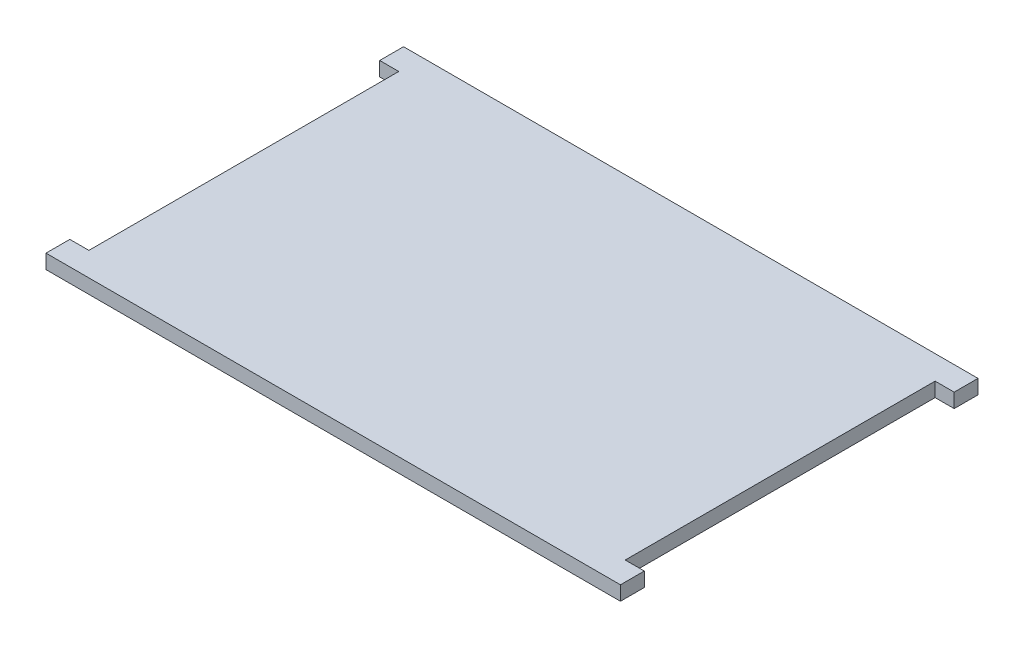
ISO-10303-21;
HEADER;
FILE_DESCRIPTION(('STEP AP214'),'2;1');
FILE_NAME('part.step','',(''),(''),'','','');
FILE_SCHEMA(('AUTOMOTIVE_DESIGN { 1 0 10303 214 1 1 1 1 }'));
ENDSEC;
DATA;
#1=APPLICATION_CONTEXT('core data for automotive mechanical design processes');
#2=APPLICATION_PROTOCOL_DEFINITION('international standard','automotive_design',2000,#1);
#3=PRODUCT_CONTEXT('',#1,'mechanical');
#4=PRODUCT('Part','Part','',(#3));
#5=PRODUCT_RELATED_PRODUCT_CATEGORY('part','',(#4));
#6=PRODUCT_DEFINITION_FORMATION('','',#4);
#7=PRODUCT_DEFINITION_CONTEXT('part definition',#1,'design');
#8=PRODUCT_DEFINITION('design','',#6,#7);
#9=PRODUCT_DEFINITION_SHAPE('','',#8);
#10=(LENGTH_UNIT() NAMED_UNIT(*) SI_UNIT(.MILLI.,.METRE.));
#11=(NAMED_UNIT(*) PLANE_ANGLE_UNIT() SI_UNIT($,.RADIAN.));
#12=(NAMED_UNIT(*) SI_UNIT($,.STERADIAN.) SOLID_ANGLE_UNIT());
#13=UNCERTAINTY_MEASURE_WITH_UNIT(LENGTH_MEASURE(1.E-05),#10,'distance_accuracy_value','');
#14=(GEOMETRIC_REPRESENTATION_CONTEXT(3) GLOBAL_UNCERTAINTY_ASSIGNED_CONTEXT((#13)) GLOBAL_UNIT_ASSIGNED_CONTEXT((#10,
#11,#12)) REPRESENTATION_CONTEXT('',''));
#15=CARTESIAN_POINT('',(0.,0.,0.));
#16=DIRECTION('',(0.,0.,1.));
#17=DIRECTION('',(1.,0.,0.));
#18=AXIS2_PLACEMENT_3D('',#15,#16,#17);
#19=CARTESIAN_POINT('',(-120.5,6.,-75.));
#20=DIRECTION('',(1.,0.,0.));
#21=DIRECTION('',(0.,0.,-1.));
#22=AXIS2_PLACEMENT_3D('',#19,#20,#21);
#23=PLANE('',#22);
#24=DIRECTION('',(0.,0.,1.));
#25=VECTOR('',#24,1.);
#26=CARTESIAN_POINT('',(-120.5,0.,-75.));
#27=LINE('',#26,#25);
#28=CARTESIAN_POINT('',(-120.5,0.,-75.));
#29=VERTEX_POINT('',#28);
#30=CARTESIAN_POINT('',(-120.5,0.,-65.));
#31=VERTEX_POINT('',#30);
#32=EDGE_CURVE('E154',#29,#31,#27,.T.);
#33=ORIENTED_EDGE('',*,*,#32,.T.);
#34=DIRECTION('',(0.,-1.,0.));
#35=VECTOR('',#34,1.);
#36=CARTESIAN_POINT('',(-120.5,6.,-65.));
#37=LINE('',#36,#35);
#38=CARTESIAN_POINT('',(-120.5,6.,-65.));
#39=VERTEX_POINT('',#38);
#40=EDGE_CURVE('E11',#39,#31,#37,.T.);
#41=ORIENTED_EDGE('',*,*,#40,.F.);
#42=DIRECTION('',(0.,0.,1.));
#43=VECTOR('',#42,1.);
#44=CARTESIAN_POINT('',(-120.5,6.,-75.));
#45=LINE('',#44,#43);
#46=CARTESIAN_POINT('',(-120.5,6.,-75.));
#47=VERTEX_POINT('',#46);
#48=EDGE_CURVE('E176',#47,#39,#45,.T.);
#49=ORIENTED_EDGE('',*,*,#48,.F.);
#50=DIRECTION('',(0.,-1.,0.));
#51=VECTOR('',#50,1.);
#52=CARTESIAN_POINT('',(-120.5,6.,-75.));
#53=LINE('',#52,#51);
#54=EDGE_CURVE('E150',#47,#29,#53,.T.);
#55=ORIENTED_EDGE('',*,*,#54,.T.);
#56=EDGE_LOOP('',(#33,#41,#49,#55));
#57=FACE_BOUND('',#56,.T.);
#58=ADVANCED_FACE('F34',(#57),#23,.F.);
#59=CARTESIAN_POINT('',(-120.5,6.,-65.));
#60=DIRECTION('',(0.,0.,-1.));
#61=DIRECTION('',(-1.,0.,0.));
#62=AXIS2_PLACEMENT_3D('',#59,#60,#61);
#63=PLANE('',#62);
#64=DIRECTION('',(1.,0.,0.));
#65=VECTOR('',#64,1.);
#66=CARTESIAN_POINT('',(-120.5,0.,-65.));
#67=LINE('',#66,#65);
#68=CARTESIAN_POINT('',(-112.5,0.,-65.));
#69=VERTEX_POINT('',#68);
#70=EDGE_CURVE('E157',#31,#69,#67,.T.);
#71=ORIENTED_EDGE('',*,*,#70,.T.);
#72=DIRECTION('',(0.,-1.,0.));
#73=VECTOR('',#72,1.);
#74=CARTESIAN_POINT('',(-112.5,6.,-65.));
#75=LINE('',#74,#73);
#76=CARTESIAN_POINT('',(-112.5,6.,-65.));
#77=VERTEX_POINT('',#76);
#78=EDGE_CURVE('E42',#77,#69,#75,.T.);
#79=ORIENTED_EDGE('',*,*,#78,.F.);
#80=DIRECTION('',(1.,0.,0.));
#81=VECTOR('',#80,1.);
#82=CARTESIAN_POINT('',(-120.5,6.,-65.));
#83=LINE('',#82,#81);
#84=EDGE_CURVE('E105',#39,#77,#83,.T.);
#85=ORIENTED_EDGE('',*,*,#84,.F.);
#86=ORIENTED_EDGE('',*,*,#40,.T.);
#87=EDGE_LOOP('',(#71,#79,#85,#86));
#88=FACE_BOUND('',#87,.T.);
#89=ADVANCED_FACE('F254',(#88),#63,.F.);
#90=CARTESIAN_POINT('',(-112.5,6.,-65.));
#91=DIRECTION('',(1.,0.,0.));
#92=DIRECTION('',(0.,0.,-1.));
#93=AXIS2_PLACEMENT_3D('',#90,#91,#92);
#94=PLANE('',#93);
#95=DIRECTION('',(0.,0.,1.));
#96=VECTOR('',#95,1.);
#97=CARTESIAN_POINT('',(-112.5,0.,-65.));
#98=LINE('',#97,#96);
#99=CARTESIAN_POINT('',(-112.5,0.,65.));
#100=VERTEX_POINT('',#99);
#101=EDGE_CURVE('E159',#69,#100,#98,.T.);
#102=ORIENTED_EDGE('',*,*,#101,.T.);
#103=DIRECTION('',(0.,-1.,0.));
#104=VECTOR('',#103,1.);
#105=CARTESIAN_POINT('',(-112.5,6.,65.));
#106=LINE('',#105,#104);
#107=CARTESIAN_POINT('',(-112.5,6.,65.));
#108=VERTEX_POINT('',#107);
#109=EDGE_CURVE('E195',#108,#100,#106,.T.);
#110=ORIENTED_EDGE('',*,*,#109,.F.);
#111=DIRECTION('',(0.,0.,1.));
#112=VECTOR('',#111,1.);
#113=CARTESIAN_POINT('',(-112.5,6.,-65.));
#114=LINE('',#113,#112);
#115=EDGE_CURVE('E203',#77,#108,#114,.T.);
#116=ORIENTED_EDGE('',*,*,#115,.F.);
#117=ORIENTED_EDGE('',*,*,#78,.T.);
#118=EDGE_LOOP('',(#102,#110,#116,#117));
#119=FACE_BOUND('',#118,.T.);
#120=ADVANCED_FACE('F201',(#119),#94,.F.);
#121=CARTESIAN_POINT('',(-120.5,6.,65.));
#122=DIRECTION('',(0.,0.,1.));
#123=DIRECTION('',(1.,0.,0.));
#124=AXIS2_PLACEMENT_3D('',#121,#122,#123);
#125=PLANE('',#124);
#126=DIRECTION('',(-1.,0.,0.));
#127=VECTOR('',#126,1.);
#128=CARTESIAN_POINT('',(-120.5,0.,65.));
#129=LINE('',#128,#127);
#130=CARTESIAN_POINT('',(-120.5,0.,65.));
#131=VERTEX_POINT('',#130);
#132=EDGE_CURVE('E161',#100,#131,#129,.T.);
#133=ORIENTED_EDGE('',*,*,#132,.T.);
#134=DIRECTION('',(0.,-1.,0.));
#135=VECTOR('',#134,1.);
#136=CARTESIAN_POINT('',(-120.5,6.,65.));
#137=LINE('',#136,#135);
#138=CARTESIAN_POINT('',(-120.5,6.,65.));
#139=VERTEX_POINT('',#138);
#140=EDGE_CURVE('E192',#139,#131,#137,.T.);
#141=ORIENTED_EDGE('',*,*,#140,.F.);
#142=DIRECTION('',(-1.,0.,0.));
#143=VECTOR('',#142,1.);
#144=CARTESIAN_POINT('',(-120.5,6.,65.));
#145=LINE('',#144,#143);
#146=EDGE_CURVE('E221',#108,#139,#145,.T.);
#147=ORIENTED_EDGE('',*,*,#146,.F.);
#148=ORIENTED_EDGE('',*,*,#109,.T.);
#149=EDGE_LOOP('',(#133,#141,#147,#148));
#150=FACE_BOUND('',#149,.T.);
#151=ADVANCED_FACE('F212',(#150),#125,.F.);
#152=CARTESIAN_POINT('',(-120.5,6.,75.));
#153=DIRECTION('',(1.,0.,0.));
#154=DIRECTION('',(0.,0.,-1.));
#155=AXIS2_PLACEMENT_3D('',#152,#153,#154);
#156=PLANE('',#155);
#157=DIRECTION('',(0.,0.,1.));
#158=VECTOR('',#157,1.);
#159=CARTESIAN_POINT('',(-120.5,0.,75.));
#160=LINE('',#159,#158);
#161=CARTESIAN_POINT('',(-120.5,0.,75.));
#162=VERTEX_POINT('',#161);
#163=EDGE_CURVE('E163',#131,#162,#160,.T.);
#164=ORIENTED_EDGE('',*,*,#163,.T.);
#165=DIRECTION('',(0.,-1.,0.));
#166=VECTOR('',#165,1.);
#167=CARTESIAN_POINT('',(-120.5,6.,75.));
#168=LINE('',#167,#166);
#169=CARTESIAN_POINT('',(-120.5,6.,75.));
#170=VERTEX_POINT('',#169);
#171=EDGE_CURVE('E189',#170,#162,#168,.T.);
#172=ORIENTED_EDGE('',*,*,#171,.F.);
#173=DIRECTION('',(0.,0.,1.));
#174=VECTOR('',#173,1.);
#175=CARTESIAN_POINT('',(-120.5,6.,75.));
#176=LINE('',#175,#174);
#177=EDGE_CURVE('E218',#139,#170,#176,.T.);
#178=ORIENTED_EDGE('',*,*,#177,.F.);
#179=ORIENTED_EDGE('',*,*,#140,.T.);
#180=EDGE_LOOP('',(#164,#172,#178,#179));
#181=FACE_BOUND('',#180,.T.);
#182=ADVANCED_FACE('F216',(#181),#156,.F.);
#183=CARTESIAN_POINT('',(-120.5,6.,75.));
#184=DIRECTION('',(0.,0.,-1.));
#185=DIRECTION('',(-1.,0.,0.));
#186=AXIS2_PLACEMENT_3D('',#183,#184,#185);
#187=PLANE('',#186);
#188=DIRECTION('',(1.,0.,0.));
#189=VECTOR('',#188,1.);
#190=CARTESIAN_POINT('',(-120.5,0.,75.));
#191=LINE('',#190,#189);
#192=CARTESIAN_POINT('',(120.5,0.,75.));
#193=VERTEX_POINT('',#192);
#194=EDGE_CURVE('E165',#162,#193,#191,.T.);
#195=ORIENTED_EDGE('',*,*,#194,.T.);
#196=DIRECTION('',(0.,-1.,0.));
#197=VECTOR('',#196,1.);
#198=CARTESIAN_POINT('',(120.5,6.,75.));
#199=LINE('',#198,#197);
#200=CARTESIAN_POINT('',(120.5,6.,75.));
#201=VERTEX_POINT('',#200);
#202=EDGE_CURVE('E186',#201,#193,#199,.T.);
#203=ORIENTED_EDGE('',*,*,#202,.F.);
#204=DIRECTION('',(1.,0.,0.));
#205=VECTOR('',#204,1.);
#206=CARTESIAN_POINT('',(-120.5,6.,75.));
#207=LINE('',#206,#205);
#208=EDGE_CURVE('E220',#170,#201,#207,.T.);
#209=ORIENTED_EDGE('',*,*,#208,.F.);
#210=ORIENTED_EDGE('',*,*,#171,.T.);
#211=EDGE_LOOP('',(#195,#203,#209,#210));
#212=FACE_BOUND('',#211,.T.);
#213=ADVANCED_FACE('F267',(#212),#187,.F.);
#214=CARTESIAN_POINT('',(120.5,6.,75.));
#215=DIRECTION('',(-1.,0.,0.));
#216=DIRECTION('',(0.,0.,1.));
#217=AXIS2_PLACEMENT_3D('',#214,#215,#216);
#218=PLANE('',#217);
#219=DIRECTION('',(0.,0.,-1.));
#220=VECTOR('',#219,1.);
#221=CARTESIAN_POINT('',(120.5,0.,75.));
#222=LINE('',#221,#220);
#223=CARTESIAN_POINT('',(120.5,0.,65.));
#224=VERTEX_POINT('',#223);
#225=EDGE_CURVE('E167',#193,#224,#222,.T.);
#226=ORIENTED_EDGE('',*,*,#225,.T.);
#227=DIRECTION('',(0.,-1.,0.));
#228=VECTOR('',#227,1.);
#229=CARTESIAN_POINT('',(120.5,6.,65.));
#230=LINE('',#229,#228);
#231=CARTESIAN_POINT('',(120.5,6.,65.));
#232=VERTEX_POINT('',#231);
#233=EDGE_CURVE('E183',#232,#224,#230,.T.);
#234=ORIENTED_EDGE('',*,*,#233,.F.);
#235=DIRECTION('',(0.,0.,-1.));
#236=VECTOR('',#235,1.);
#237=CARTESIAN_POINT('',(120.5,6.,75.));
#238=LINE('',#237,#236);
#239=EDGE_CURVE('E223',#201,#232,#238,.T.);
#240=ORIENTED_EDGE('',*,*,#239,.F.);
#241=ORIENTED_EDGE('',*,*,#202,.T.);
#242=EDGE_LOOP('',(#226,#234,#240,#241));
#243=FACE_BOUND('',#242,.T.);
#244=ADVANCED_FACE('F270',(#243),#218,.F.);
#245=CARTESIAN_POINT('',(120.5,6.,65.));
#246=DIRECTION('',(0.,0.,1.));
#247=DIRECTION('',(1.,0.,0.));
#248=AXIS2_PLACEMENT_3D('',#245,#246,#247);
#249=PLANE('',#248);
#250=DIRECTION('',(-1.,0.,0.));
#251=VECTOR('',#250,1.);
#252=CARTESIAN_POINT('',(120.5,0.,65.));
#253=LINE('',#252,#251);
#254=CARTESIAN_POINT('',(112.5,0.,65.));
#255=VERTEX_POINT('',#254);
#256=EDGE_CURVE('E169',#224,#255,#253,.T.);
#257=ORIENTED_EDGE('',*,*,#256,.T.);
#258=DIRECTION('',(0.,-1.,0.));
#259=VECTOR('',#258,1.);
#260=CARTESIAN_POINT('',(112.5,6.,65.));
#261=LINE('',#260,#259);
#262=CARTESIAN_POINT('',(112.5,6.,65.));
#263=VERTEX_POINT('',#262);
#264=EDGE_CURVE('E180',#263,#255,#261,.T.);
#265=ORIENTED_EDGE('',*,*,#264,.F.);
#266=DIRECTION('',(-1.,0.,0.));
#267=VECTOR('',#266,1.);
#268=CARTESIAN_POINT('',(120.5,6.,65.));
#269=LINE('',#268,#267);
#270=EDGE_CURVE('E229',#232,#263,#269,.T.);
#271=ORIENTED_EDGE('',*,*,#270,.F.);
#272=ORIENTED_EDGE('',*,*,#233,.T.);
#273=EDGE_LOOP('',(#257,#265,#271,#272));
#274=FACE_BOUND('',#273,.T.);
#275=ADVANCED_FACE('F235',(#274),#249,.F.);
#276=CARTESIAN_POINT('',(112.5,6.,-65.));
#277=DIRECTION('',(-1.,0.,0.));
#278=DIRECTION('',(0.,0.,1.));
#279=AXIS2_PLACEMENT_3D('',#276,#277,#278);
#280=PLANE('',#279);
#281=DIRECTION('',(0.,0.,-1.));
#282=VECTOR('',#281,1.);
#283=CARTESIAN_POINT('',(112.5,0.,-65.));
#284=LINE('',#283,#282);
#285=CARTESIAN_POINT('',(112.5,0.,-65.));
#286=VERTEX_POINT('',#285);
#287=EDGE_CURVE('E171',#255,#286,#284,.T.);
#288=ORIENTED_EDGE('',*,*,#287,.T.);
#289=DIRECTION('',(0.,-1.,0.));
#290=VECTOR('',#289,1.);
#291=CARTESIAN_POINT('',(112.5,6.,-65.));
#292=LINE('',#291,#290);
#293=CARTESIAN_POINT('',(112.5,6.,-65.));
#294=VERTEX_POINT('',#293);
#295=EDGE_CURVE('E145',#294,#286,#292,.T.);
#296=ORIENTED_EDGE('',*,*,#295,.F.);
#297=DIRECTION('',(0.,0.,-1.));
#298=VECTOR('',#297,1.);
#299=CARTESIAN_POINT('',(112.5,6.,-65.));
#300=LINE('',#299,#298);
#301=EDGE_CURVE('E136',#263,#294,#300,.T.);
#302=ORIENTED_EDGE('',*,*,#301,.F.);
#303=ORIENTED_EDGE('',*,*,#264,.T.);
#304=EDGE_LOOP('',(#288,#296,#302,#303));
#305=FACE_BOUND('',#304,.T.);
#306=ADVANCED_FACE('F239',(#305),#280,.F.);
#307=CARTESIAN_POINT('',(120.5,6.,-65.));
#308=DIRECTION('',(0.,0.,-1.));
#309=DIRECTION('',(-1.,0.,0.));
#310=AXIS2_PLACEMENT_3D('',#307,#308,#309);
#311=PLANE('',#310);
#312=DIRECTION('',(1.,0.,0.));
#313=VECTOR('',#312,1.);
#314=CARTESIAN_POINT('',(120.5,0.,-65.));
#315=LINE('',#314,#313);
#316=CARTESIAN_POINT('',(120.5,0.,-65.));
#317=VERTEX_POINT('',#316);
#318=EDGE_CURVE('E144',#286,#317,#315,.T.);
#319=ORIENTED_EDGE('',*,*,#318,.T.);
#320=DIRECTION('',(0.,-1.,0.));
#321=VECTOR('',#320,1.);
#322=CARTESIAN_POINT('',(120.5,6.,-65.));
#323=LINE('',#322,#321);
#324=CARTESIAN_POINT('',(120.5,6.,-65.));
#325=VERTEX_POINT('',#324);
#326=EDGE_CURVE('E141',#325,#317,#323,.T.);
#327=ORIENTED_EDGE('',*,*,#326,.F.);
#328=DIRECTION('',(1.,0.,0.));
#329=VECTOR('',#328,1.);
#330=CARTESIAN_POINT('',(120.5,6.,-65.));
#331=LINE('',#330,#329);
#332=EDGE_CURVE('E130',#294,#325,#331,.T.);
#333=ORIENTED_EDGE('',*,*,#332,.F.);
#334=ORIENTED_EDGE('',*,*,#295,.T.);
#335=EDGE_LOOP('',(#319,#327,#333,#334));
#336=FACE_BOUND('',#335,.T.);
#337=ADVANCED_FACE('F142',(#336),#311,.F.);
#338=CARTESIAN_POINT('',(120.5,6.,-75.));
#339=DIRECTION('',(-1.,0.,0.));
#340=DIRECTION('',(0.,0.,1.));
#341=AXIS2_PLACEMENT_3D('',#338,#339,#340);
#342=PLANE('',#341);
#343=DIRECTION('',(0.,0.,-1.));
#344=VECTOR('',#343,1.);
#345=CARTESIAN_POINT('',(120.5,0.,-75.));
#346=LINE('',#345,#344);
#347=CARTESIAN_POINT('',(120.5,0.,-75.));
#348=VERTEX_POINT('',#347);
#349=EDGE_CURVE('E91',#317,#348,#346,.T.);
#350=ORIENTED_EDGE('',*,*,#349,.T.);
#351=DIRECTION('',(0.,-1.,0.));
#352=VECTOR('',#351,1.);
#353=CARTESIAN_POINT('',(120.5,6.,-75.));
#354=LINE('',#353,#352);
#355=CARTESIAN_POINT('',(120.5,6.,-75.));
#356=VERTEX_POINT('',#355);
#357=EDGE_CURVE('E146',#356,#348,#354,.T.);
#358=ORIENTED_EDGE('',*,*,#357,.F.);
#359=DIRECTION('',(0.,0.,-1.));
#360=VECTOR('',#359,1.);
#361=CARTESIAN_POINT('',(120.5,6.,-75.));
#362=LINE('',#361,#360);
#363=EDGE_CURVE('E134',#325,#356,#362,.T.);
#364=ORIENTED_EDGE('',*,*,#363,.F.);
#365=ORIENTED_EDGE('',*,*,#326,.T.);
#366=EDGE_LOOP('',(#350,#358,#364,#365));
#367=FACE_BOUND('',#366,.T.);
#368=ADVANCED_FACE('F148',(#367),#342,.F.);
#369=CARTESIAN_POINT('',(-120.5,6.,-75.));
#370=DIRECTION('',(0.,0.,1.));
#371=DIRECTION('',(1.,0.,0.));
#372=AXIS2_PLACEMENT_3D('',#369,#370,#371);
#373=PLANE('',#372);
#374=DIRECTION('',(-1.,0.,0.));
#375=VECTOR('',#374,1.);
#376=CARTESIAN_POINT('',(-120.5,0.,-75.));
#377=LINE('',#376,#375);
#378=EDGE_CURVE('E97',#348,#29,#377,.T.);
#379=ORIENTED_EDGE('',*,*,#378,.T.);
#380=ORIENTED_EDGE('',*,*,#54,.F.);
#381=DIRECTION('',(-1.,0.,0.));
#382=VECTOR('',#381,1.);
#383=CARTESIAN_POINT('',(-120.5,6.,-75.));
#384=LINE('',#383,#382);
#385=EDGE_CURVE('E50',#356,#47,#384,.T.);
#386=ORIENTED_EDGE('',*,*,#385,.F.);
#387=ORIENTED_EDGE('',*,*,#357,.T.);
#388=EDGE_LOOP('',(#379,#380,#386,#387));
#389=FACE_BOUND('',#388,.T.);
#390=ADVANCED_FACE('F243',(#389),#373,.F.);
#391=CARTESIAN_POINT('',(0.,6.,0.));
#392=DIRECTION('',(0.,1.,0.));
#393=DIRECTION('',(0.,0.,1.));
#394=AXIS2_PLACEMENT_3D('',#391,#392,#393);
#395=PLANE('',#394);
#396=ORIENTED_EDGE('',*,*,#48,.T.);
#397=ORIENTED_EDGE('',*,*,#84,.T.);
#398=ORIENTED_EDGE('',*,*,#115,.T.);
#399=ORIENTED_EDGE('',*,*,#146,.T.);
#400=ORIENTED_EDGE('',*,*,#177,.T.);
#401=ORIENTED_EDGE('',*,*,#208,.T.);
#402=ORIENTED_EDGE('',*,*,#239,.T.);
#403=ORIENTED_EDGE('',*,*,#270,.T.);
#404=ORIENTED_EDGE('',*,*,#301,.T.);
#405=ORIENTED_EDGE('',*,*,#332,.T.);
#406=ORIENTED_EDGE('',*,*,#363,.T.);
#407=ORIENTED_EDGE('',*,*,#385,.T.);
#408=EDGE_LOOP('',(#396,#397,#398,#399,#400,#401,#402,#403,#404,#405,#406,#407));
#409=FACE_BOUND('',#408,.T.);
#410=ADVANCED_FACE('F132',(#409),#395,.T.);
#411=CARTESIAN_POINT('',(0.,0.,0.));
#412=DIRECTION('',(0.,1.,0.));
#413=DIRECTION('',(0.,0.,1.));
#414=AXIS2_PLACEMENT_3D('',#411,#412,#413);
#415=PLANE('',#414);
#416=ORIENTED_EDGE('',*,*,#32,.F.);
#417=ORIENTED_EDGE('',*,*,#378,.F.);
#418=ORIENTED_EDGE('',*,*,#349,.F.);
#419=ORIENTED_EDGE('',*,*,#318,.F.);
#420=ORIENTED_EDGE('',*,*,#287,.F.);
#421=ORIENTED_EDGE('',*,*,#256,.F.);
#422=ORIENTED_EDGE('',*,*,#225,.F.);
#423=ORIENTED_EDGE('',*,*,#194,.F.);
#424=ORIENTED_EDGE('',*,*,#163,.F.);
#425=ORIENTED_EDGE('',*,*,#132,.F.);
#426=ORIENTED_EDGE('',*,*,#101,.F.);
#427=ORIENTED_EDGE('',*,*,#70,.F.);
#428=EDGE_LOOP('',(#416,#417,#418,#419,#420,#421,#422,#423,#424,#425,#426,#427));
#429=FACE_BOUND('',#428,.T.);
#430=ADVANCED_FACE('F207',(#429),#415,.F.);
#431=CLOSED_SHELL('',(#58,#89,#120,#151,#182,#213,#244,#275,#306,#337,#368,#390,#410,#430));
#432=MANIFOLD_SOLID_BREP('B2',#431);
#433=ADVANCED_BREP_SHAPE_REPRESENTATION('',(#18,#432),#14);
#434=SHAPE_DEFINITION_REPRESENTATION(#9,#433);
ENDSEC;
END-ISO-10303-21;
